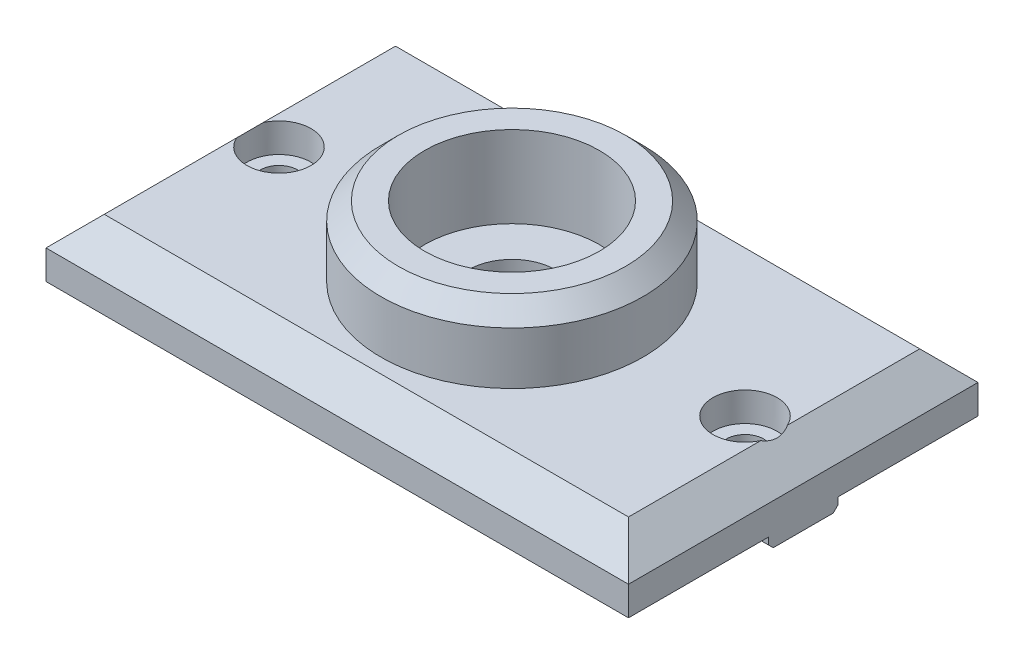
ISO-10303-21;
HEADER;
FILE_DESCRIPTION(('STEP AP214'),'2;1');
FILE_NAME('part.step','',(''),(''),'','','');
FILE_SCHEMA(('AUTOMOTIVE_DESIGN { 1 0 10303 214 1 1 1 1 }'));
ENDSEC;
DATA;
#1=APPLICATION_CONTEXT('core data for automotive mechanical design processes');
#2=APPLICATION_PROTOCOL_DEFINITION('international standard','automotive_design',2000,#1);
#3=PRODUCT_CONTEXT('',#1,'mechanical');
#4=PRODUCT('Part','Part','',(#3));
#5=PRODUCT_RELATED_PRODUCT_CATEGORY('part','',(#4));
#6=PRODUCT_DEFINITION_FORMATION('','',#4);
#7=PRODUCT_DEFINITION_CONTEXT('part definition',#1,'design');
#8=PRODUCT_DEFINITION('design','',#6,#7);
#9=PRODUCT_DEFINITION_SHAPE('','',#8);
#10=(LENGTH_UNIT() NAMED_UNIT(*) SI_UNIT(.MILLI.,.METRE.));
#11=(NAMED_UNIT(*) PLANE_ANGLE_UNIT() SI_UNIT($,.RADIAN.));
#12=(NAMED_UNIT(*) SI_UNIT($,.STERADIAN.) SOLID_ANGLE_UNIT());
#13=UNCERTAINTY_MEASURE_WITH_UNIT(LENGTH_MEASURE(1.E-05),#10,'distance_accuracy_value','');
#14=(GEOMETRIC_REPRESENTATION_CONTEXT(3) GLOBAL_UNCERTAINTY_ASSIGNED_CONTEXT((#13)) GLOBAL_UNIT_ASSIGNED_CONTEXT((#10,
#11,#12)) REPRESENTATION_CONTEXT('',''));
#15=CARTESIAN_POINT('',(0.,0.,0.));
#16=DIRECTION('',(0.,0.,1.));
#17=DIRECTION('',(1.,0.,0.));
#18=AXIS2_PLACEMENT_3D('',#15,#16,#17);
#19=CARTESIAN_POINT('',(50.,-1.99999999999999,-5.95));
#20=DIRECTION('',(0.,0.,-1.));
#21=DIRECTION('',(-1.,0.,0.));
#22=AXIS2_PLACEMENT_3D('',#19,#20,#21);
#23=PLANE('',#22);
#24=DIRECTION('',(0.,1.,0.));
#25=VECTOR('',#24,1.);
#26=CARTESIAN_POINT('',(50.,-1.99999999999999,-5.95));
#27=LINE('',#26,#25);
#28=CARTESIAN_POINT('',(50.,-1.2,-5.95));
#29=VERTEX_POINT('',#28);
#30=CARTESIAN_POINT('',(50.,0.,-5.95));
#31=VERTEX_POINT('',#30);
#32=EDGE_CURVE('E225',#29,#31,#27,.T.);
#33=ORIENTED_EDGE('',*,*,#32,.F.);
#34=DIRECTION('',(-1.,0.,0.));
#35=VECTOR('',#34,1.);
#36=CARTESIAN_POINT('',(4.56590626272594,-1.2,-5.95));
#37=LINE('',#36,#35);
#38=CARTESIAN_POINT('',(4.56590626272594,-1.2,-5.95));
#39=VERTEX_POINT('',#38);
#40=EDGE_CURVE('E11',#29,#39,#37,.T.);
#41=ORIENTED_EDGE('',*,*,#40,.T.);
#42=DIRECTION('',(0.,-1.,0.));
#43=VECTOR('',#42,1.);
#44=CARTESIAN_POINT('',(4.56590626272594,22.,-5.95));
#45=LINE('',#44,#43);
#46=CARTESIAN_POINT('',(4.56590626272594,0.,-5.95));
#47=VERTEX_POINT('',#46);
#48=EDGE_CURVE('E440',#39,#47,#45,.F.);
#49=ORIENTED_EDGE('',*,*,#48,.T.);
#50=DIRECTION('',(-1.,0.,0.));
#51=VECTOR('',#50,1.);
#52=CARTESIAN_POINT('',(50.,0.,-5.95));
#53=LINE('',#52,#51);
#54=EDGE_CURVE('E215',#31,#47,#53,.T.);
#55=ORIENTED_EDGE('',*,*,#54,.F.);
#56=EDGE_LOOP('',(#33,#41,#49,#55));
#57=FACE_BOUND('',#56,.T.);
#58=ADVANCED_FACE('F41',(#57),#23,.T.);
#59=DIRECTION('',(0.,-1.,0.));
#60=VECTOR('',#59,1.);
#61=CARTESIAN_POINT('',(-4.56590626272594,22.,-5.95));
#62=LINE('',#61,#60);
#63=CARTESIAN_POINT('',(-4.56590626272594,0.,-5.95));
#64=VERTEX_POINT('',#63);
#65=CARTESIAN_POINT('',(-4.56590626272594,-1.2,-5.95));
#66=VERTEX_POINT('',#65);
#67=EDGE_CURVE('E400',#64,#66,#62,.T.);
#68=ORIENTED_EDGE('',*,*,#67,.T.);
#69=DIRECTION('',(-1.,0.,0.));
#70=VECTOR('',#69,1.);
#71=CARTESIAN_POINT('',(-50.,-1.2,-5.95));
#72=LINE('',#71,#70);
#73=CARTESIAN_POINT('',(-50.,-1.2,-5.95));
#74=VERTEX_POINT('',#73);
#75=EDGE_CURVE('E51',#66,#74,#72,.T.);
#76=ORIENTED_EDGE('',*,*,#75,.T.);
#77=DIRECTION('',(0.,1.,0.));
#78=VECTOR('',#77,1.);
#79=CARTESIAN_POINT('',(-50.,-1.99999999999999,-5.95));
#80=LINE('',#79,#78);
#81=CARTESIAN_POINT('',(-50.,0.,-5.95));
#82=VERTEX_POINT('',#81);
#83=EDGE_CURVE('E234',#74,#82,#80,.T.);
#84=ORIENTED_EDGE('',*,*,#83,.T.);
#85=EDGE_CURVE('E221',#64,#82,#53,.T.);
#86=ORIENTED_EDGE('',*,*,#85,.F.);
#87=EDGE_LOOP('',(#68,#76,#84,#86));
#88=FACE_BOUND('',#87,.T.);
#89=ADVANCED_FACE('F397',(#88),#23,.T.);
#90=CARTESIAN_POINT('',(50.,-1.99999999999999,5.95));
#91=DIRECTION('',(0.,0.,1.));
#92=DIRECTION('',(1.,0.,0.));
#93=AXIS2_PLACEMENT_3D('',#90,#91,#92);
#94=PLANE('',#93);
#95=DIRECTION('',(0.,1.,0.));
#96=VECTOR('',#95,1.);
#97=CARTESIAN_POINT('',(-50.,-1.99999999999999,5.95));
#98=LINE('',#97,#96);
#99=CARTESIAN_POINT('',(-50.,-1.2,5.95));
#100=VERTEX_POINT('',#99);
#101=CARTESIAN_POINT('',(-50.,0.,5.95));
#102=VERTEX_POINT('',#101);
#103=EDGE_CURVE('E231',#100,#102,#98,.T.);
#104=ORIENTED_EDGE('',*,*,#103,.F.);
#105=DIRECTION('',(1.,0.,0.));
#106=VECTOR('',#105,1.);
#107=CARTESIAN_POINT('',(-4.56590626272594,-1.2,5.95));
#108=LINE('',#107,#106);
#109=CARTESIAN_POINT('',(-4.56590626272594,-1.2,5.95));
#110=VERTEX_POINT('',#109);
#111=EDGE_CURVE('E352',#100,#110,#108,.T.);
#112=ORIENTED_EDGE('',*,*,#111,.T.);
#113=DIRECTION('',(0.,-1.,0.));
#114=VECTOR('',#113,1.);
#115=CARTESIAN_POINT('',(-4.56590626272594,22.,5.95));
#116=LINE('',#115,#114);
#117=CARTESIAN_POINT('',(-4.56590626272594,0.,5.95));
#118=VERTEX_POINT('',#117);
#119=EDGE_CURVE('E209',#110,#118,#116,.F.);
#120=ORIENTED_EDGE('',*,*,#119,.T.);
#121=DIRECTION('',(1.,0.,0.));
#122=VECTOR('',#121,1.);
#123=CARTESIAN_POINT('',(50.,0.,5.95));
#124=LINE('',#123,#122);
#125=EDGE_CURVE('E207',#102,#118,#124,.T.);
#126=ORIENTED_EDGE('',*,*,#125,.F.);
#127=EDGE_LOOP('',(#104,#112,#120,#126));
#128=FACE_BOUND('',#127,.T.);
#129=ADVANCED_FACE('F490',(#128),#94,.T.);
#130=DIRECTION('',(0.,-1.,0.));
#131=VECTOR('',#130,1.);
#132=CARTESIAN_POINT('',(4.56590626272594,22.,5.95));
#133=LINE('',#132,#131);
#134=CARTESIAN_POINT('',(4.56590626272594,0.,5.95));
#135=VERTEX_POINT('',#134);
#136=CARTESIAN_POINT('',(4.56590626272594,-1.2,5.95));
#137=VERTEX_POINT('',#136);
#138=EDGE_CURVE('E182',#135,#137,#133,.T.);
#139=ORIENTED_EDGE('',*,*,#138,.T.);
#140=DIRECTION('',(1.,0.,0.));
#141=VECTOR('',#140,1.);
#142=CARTESIAN_POINT('',(50.,-1.2,5.95));
#143=LINE('',#142,#141);
#144=CARTESIAN_POINT('',(50.,-1.2,5.95));
#145=VERTEX_POINT('',#144);
#146=EDGE_CURVE('E379',#137,#145,#143,.T.);
#147=ORIENTED_EDGE('',*,*,#146,.T.);
#148=DIRECTION('',(0.,1.,0.));
#149=VECTOR('',#148,1.);
#150=CARTESIAN_POINT('',(50.,-1.99999999999999,5.95));
#151=LINE('',#150,#149);
#152=CARTESIAN_POINT('',(50.,0.,5.95));
#153=VERTEX_POINT('',#152);
#154=EDGE_CURVE('E213',#145,#153,#151,.T.);
#155=ORIENTED_EDGE('',*,*,#154,.T.);
#156=EDGE_CURVE('E203',#135,#153,#124,.T.);
#157=ORIENTED_EDGE('',*,*,#156,.F.);
#158=EDGE_LOOP('',(#139,#147,#155,#157));
#159=FACE_BOUND('',#158,.T.);
#160=ADVANCED_FACE('F211',(#159),#94,.T.);
#161=CARTESIAN_POINT('',(0.,-1.99999999999999,0.));
#162=DIRECTION('',(0.,1.,0.));
#163=DIRECTION('',(0.,0.,1.));
#164=AXIS2_PLACEMENT_3D('',#161,#162,#163);
#165=PLANE('',#164);
#166=CARTESIAN_POINT('',(0.,-1.99999999999999,0.));
#167=DIRECTION('',(0.,1.,0.));
#168=DIRECTION('',(0.,0.,1.));
#169=AXIS2_PLACEMENT_3D('',#166,#167,#168);
#170=CIRCLE('',#169,7.5);
#171=CARTESIAN_POINT('',(-5.45229309556997,-1.99999999999999,5.15000000000001));
#172=VERTEX_POINT('',#171);
#173=CARTESIAN_POINT('',(-5.45229309556997,-1.99999999999999,-5.15000000000001));
#174=VERTEX_POINT('',#173);
#175=EDGE_CURVE('E278',#172,#174,#170,.F.);
#176=ORIENTED_EDGE('',*,*,#175,.F.);
#177=DIRECTION('',(-1.,0.,0.));
#178=VECTOR('',#177,1.);
#179=CARTESIAN_POINT('',(-50.,-1.99999999999999,5.15000000000001));
#180=LINE('',#179,#178);
#181=CARTESIAN_POINT('',(-50.,-1.99999999999999,5.15000000000001));
#182=VERTEX_POINT('',#181);
#183=EDGE_CURVE('E370',#172,#182,#180,.T.);
#184=ORIENTED_EDGE('',*,*,#183,.T.);
#185=DIRECTION('',(0.,0.,1.));
#186=VECTOR('',#185,1.);
#187=CARTESIAN_POINT('',(-50.,-1.99999999999999,-5.95));
#188=LINE('',#187,#186);
#189=CARTESIAN_POINT('',(-50.,-1.99999999999999,-5.15));
#190=VERTEX_POINT('',#189);
#191=EDGE_CURVE('E219',#190,#182,#188,.T.);
#192=ORIENTED_EDGE('',*,*,#191,.F.);
#193=DIRECTION('',(1.,0.,0.));
#194=VECTOR('',#193,1.);
#195=CARTESIAN_POINT('',(-4.56590626272594,-1.99999999999999,-5.15000000000001));
#196=LINE('',#195,#194);
#197=EDGE_CURVE('E367',#190,#174,#196,.T.);
#198=ORIENTED_EDGE('',*,*,#197,.T.);
#199=EDGE_LOOP('',(#176,#184,#192,#198));
#200=FACE_BOUND('',#199,.T.);
#201=CARTESIAN_POINT('',(-40.,-1.99999999999999,0.));
#202=DIRECTION('',(0.,1.,0.));
#203=DIRECTION('',(0.,0.,1.));
#204=AXIS2_PLACEMENT_3D('',#201,#202,#203);
#205=CIRCLE('',#204,3.2);
#206=CARTESIAN_POINT('',(-40.,-1.99999999999999,3.2));
#207=VERTEX_POINT('',#206);
#208=EDGE_CURVE('E417',#207,#207,#205,.T.);
#209=ORIENTED_EDGE('',*,*,#208,.T.);
#210=EDGE_LOOP('',(#209));
#211=FACE_BOUND('',#210,.T.);
#212=ADVANCED_FACE('F518',(#200,#211),#165,.F.);
#213=CARTESIAN_POINT('',(0.,0.,0.));
#214=DIRECTION('',(0.,-1.,0.));
#215=DIRECTION('',(0.,0.,-1.));
#216=AXIS2_PLACEMENT_3D('',#213,#214,#215);
#217=PLANE('',#216);
#218=ORIENTED_EDGE('',*,*,#54,.T.);
#219=CARTESIAN_POINT('',(0.,0.,0.));
#220=DIRECTION('',(0.,-1.,0.));
#221=DIRECTION('',(0.,0.,-1.));
#222=AXIS2_PLACEMENT_3D('',#219,#220,#221);
#223=CIRCLE('',#222,7.5);
#224=EDGE_CURVE('E415',#47,#64,#223,.F.);
#225=ORIENTED_EDGE('',*,*,#224,.T.);
#226=ORIENTED_EDGE('',*,*,#85,.T.);
#227=DIRECTION('',(0.,0.,1.));
#228=VECTOR('',#227,1.);
#229=CARTESIAN_POINT('',(-50.,0.,30.));
#230=LINE('',#229,#228);
#231=CARTESIAN_POINT('',(-50.,0.,-30.));
#232=VERTEX_POINT('',#231);
#233=EDGE_CURVE('E258',#232,#82,#230,.T.);
#234=ORIENTED_EDGE('',*,*,#233,.F.);
#235=DIRECTION('',(-1.,0.,0.));
#236=VECTOR('',#235,1.);
#237=CARTESIAN_POINT('',(-50.,0.,-30.));
#238=LINE('',#237,#236);
#239=CARTESIAN_POINT('',(50.,0.,-30.));
#240=VERTEX_POINT('',#239);
#241=EDGE_CURVE('E253',#240,#232,#238,.T.);
#242=ORIENTED_EDGE('',*,*,#241,.F.);
#243=DIRECTION('',(0.,0.,-1.));
#244=VECTOR('',#243,1.);
#245=CARTESIAN_POINT('',(50.,0.,30.));
#246=LINE('',#245,#244);
#247=EDGE_CURVE('E249',#31,#240,#246,.T.);
#248=ORIENTED_EDGE('',*,*,#247,.F.);
#249=EDGE_LOOP('',(#218,#225,#226,#234,#242,#248));
#250=FACE_BOUND('',#249,.T.);
#251=ADVANCED_FACE('F411',(#250),#217,.T.);
#252=ORIENTED_EDGE('',*,*,#125,.T.);
#253=CARTESIAN_POINT('',(0.,0.,0.));
#254=DIRECTION('',(0.,-1.,0.));
#255=DIRECTION('',(0.,0.,-1.));
#256=AXIS2_PLACEMENT_3D('',#253,#254,#255);
#257=CIRCLE('',#256,7.5);
#258=EDGE_CURVE('E187',#118,#135,#257,.F.);
#259=ORIENTED_EDGE('',*,*,#258,.T.);
#260=ORIENTED_EDGE('',*,*,#156,.T.);
#261=CARTESIAN_POINT('',(50.,0.,30.));
#262=VERTEX_POINT('',#261);
#263=EDGE_CURVE('E250',#262,#153,#246,.T.);
#264=ORIENTED_EDGE('',*,*,#263,.F.);
#265=DIRECTION('',(1.,0.,0.));
#266=VECTOR('',#265,1.);
#267=CARTESIAN_POINT('',(-50.,0.,30.));
#268=LINE('',#267,#266);
#269=CARTESIAN_POINT('',(-50.,0.,30.));
#270=VERTEX_POINT('',#269);
#271=EDGE_CURVE('E262',#270,#262,#268,.T.);
#272=ORIENTED_EDGE('',*,*,#271,.F.);
#273=EDGE_CURVE('E257',#102,#270,#230,.T.);
#274=ORIENTED_EDGE('',*,*,#273,.F.);
#275=EDGE_LOOP('',(#252,#259,#260,#264,#272,#274));
#276=FACE_BOUND('',#275,.T.);
#277=ADVANCED_FACE('F201',(#276),#217,.T.);
#278=CARTESIAN_POINT('',(50.,10.,30.));
#279=DIRECTION('',(-1.,0.,0.));
#280=DIRECTION('',(0.,0.,1.));
#281=AXIS2_PLACEMENT_3D('',#278,#279,#280);
#282=PLANE('',#281);
#283=ORIENTED_EDGE('',*,*,#154,.F.);
#284=DIRECTION('',(0.,-0.707106781186548,-0.707106781186547));
#285=VECTOR('',#284,1.);
#286=CARTESIAN_POINT('',(50.,-1.2,5.95));
#287=LINE('',#286,#285);
#288=CARTESIAN_POINT('',(50.,-1.99999999999999,5.15));
#289=VERTEX_POINT('',#288);
#290=EDGE_CURVE('E384',#145,#289,#287,.T.);
#291=ORIENTED_EDGE('',*,*,#290,.T.);
#292=DIRECTION('',(0.,0.,-1.));
#293=VECTOR('',#292,1.);
#294=CARTESIAN_POINT('',(50.,-1.99999999999999,-5.95));
#295=LINE('',#294,#293);
#296=CARTESIAN_POINT('',(50.,-1.99999999999999,-5.15000000000001));
#297=VERTEX_POINT('',#296);
#298=EDGE_CURVE('E237',#289,#297,#295,.T.);
#299=ORIENTED_EDGE('',*,*,#298,.T.);
#300=DIRECTION('',(0.,0.707106781186547,-0.707106781186548));
#301=VECTOR('',#300,1.);
#302=CARTESIAN_POINT('',(50.,-1.2,-5.95));
#303=LINE('',#302,#301);
#304=EDGE_CURVE('E58',#297,#29,#303,.T.);
#305=ORIENTED_EDGE('',*,*,#304,.T.);
#306=ORIENTED_EDGE('',*,*,#32,.T.);
#307=ORIENTED_EDGE('',*,*,#247,.T.);
#308=DIRECTION('',(0.,-1.,0.));
#309=VECTOR('',#308,1.);
#310=CARTESIAN_POINT('',(50.,10.,-30.));
#311=LINE('',#310,#309);
#312=CARTESIAN_POINT('',(50.,4.99999999999996,-30.));
#313=VERTEX_POINT('',#312);
#314=EDGE_CURVE('E275',#313,#240,#311,.T.);
#315=ORIENTED_EDGE('',*,*,#314,.F.);
#316=DIRECTION('',(0.,0.,1.));
#317=VECTOR('',#316,1.);
#318=CARTESIAN_POINT('',(50.,4.99999999999996,30.));
#319=LINE('',#318,#317);
#320=CARTESIAN_POINT('',(50.,4.99999999999996,30.));
#321=VERTEX_POINT('',#320);
#322=EDGE_CURVE('E326',#313,#321,#319,.T.);
#323=ORIENTED_EDGE('',*,*,#322,.T.);
#324=DIRECTION('',(0.,-1.,0.));
#325=VECTOR('',#324,1.);
#326=CARTESIAN_POINT('',(50.,10.,30.));
#327=LINE('',#326,#325);
#328=EDGE_CURVE('E266',#321,#262,#327,.T.);
#329=ORIENTED_EDGE('',*,*,#328,.T.);
#330=ORIENTED_EDGE('',*,*,#263,.T.);
#331=EDGE_LOOP('',(#283,#291,#299,#305,#306,#307,#315,#323,#329,#330));
#332=FACE_BOUND('',#331,.T.);
#333=ADVANCED_FACE('F433',(#332),#282,.F.);
#334=CARTESIAN_POINT('',(-50.,10.,-30.));
#335=DIRECTION('',(0.,0.,1.));
#336=DIRECTION('',(1.,0.,0.));
#337=AXIS2_PLACEMENT_3D('',#334,#335,#336);
#338=PLANE('',#337);
#339=DIRECTION('',(0.,-1.,0.));
#340=VECTOR('',#339,1.);
#341=CARTESIAN_POINT('',(-50.,10.,-30.));
#342=LINE('',#341,#340);
#343=CARTESIAN_POINT('',(-50.,4.99999999999996,-30.));
#344=VERTEX_POINT('',#343);
#345=EDGE_CURVE('E272',#344,#232,#342,.T.);
#346=ORIENTED_EDGE('',*,*,#345,.F.);
#347=DIRECTION('',(1.,0.,0.));
#348=VECTOR('',#347,1.);
#349=CARTESIAN_POINT('',(-50.,4.99999999999996,-30.));
#350=LINE('',#349,#348);
#351=EDGE_CURVE('E320',#344,#313,#350,.T.);
#352=ORIENTED_EDGE('',*,*,#351,.T.);
#353=ORIENTED_EDGE('',*,*,#314,.T.);
#354=ORIENTED_EDGE('',*,*,#241,.T.);
#355=EDGE_LOOP('',(#346,#352,#353,#354));
#356=FACE_BOUND('',#355,.T.);
#357=ADVANCED_FACE('F524',(#356),#338,.F.);
#358=CARTESIAN_POINT('',(-50.,10.,30.));
#359=DIRECTION('',(1.,0.,0.));
#360=DIRECTION('',(0.,0.,-1.));
#361=AXIS2_PLACEMENT_3D('',#358,#359,#360);
#362=PLANE('',#361);
#363=ORIENTED_EDGE('',*,*,#191,.T.);
#364=DIRECTION('',(0.,0.707106781186548,0.707106781186547));
#365=VECTOR('',#364,1.);
#366=CARTESIAN_POINT('',(-50.,-1.2,5.95));
#367=LINE('',#366,#365);
#368=EDGE_CURVE('E376',#182,#100,#367,.T.);
#369=ORIENTED_EDGE('',*,*,#368,.T.);
#370=ORIENTED_EDGE('',*,*,#103,.T.);
#371=ORIENTED_EDGE('',*,*,#273,.T.);
#372=DIRECTION('',(0.,-1.,0.));
#373=VECTOR('',#372,1.);
#374=CARTESIAN_POINT('',(-50.,10.,30.));
#375=LINE('',#374,#373);
#376=CARTESIAN_POINT('',(-50.,4.99999999999996,30.));
#377=VERTEX_POINT('',#376);
#378=EDGE_CURVE('E269',#377,#270,#375,.T.);
#379=ORIENTED_EDGE('',*,*,#378,.F.);
#380=DIRECTION('',(0.,0.,-1.));
#381=VECTOR('',#380,1.);
#382=CARTESIAN_POINT('',(-50.,4.99999999999996,30.));
#383=LINE('',#382,#381);
#384=EDGE_CURVE('E317',#377,#344,#383,.T.);
#385=ORIENTED_EDGE('',*,*,#384,.T.);
#386=ORIENTED_EDGE('',*,*,#345,.T.);
#387=ORIENTED_EDGE('',*,*,#233,.T.);
#388=ORIENTED_EDGE('',*,*,#83,.F.);
#389=DIRECTION('',(0.,-0.707106781186547,0.707106781186548));
#390=VECTOR('',#389,1.);
#391=CARTESIAN_POINT('',(-50.,-1.19999999999999,-5.95));
#392=LINE('',#391,#390);
#393=EDGE_CURVE('E373',#74,#190,#392,.T.);
#394=ORIENTED_EDGE('',*,*,#393,.T.);
#395=EDGE_LOOP('',(#363,#369,#370,#371,#379,#385,#386,#387,#388,#394));
#396=FACE_BOUND('',#395,.T.);
#397=ADVANCED_FACE('F405',(#396),#362,.F.);
#398=CARTESIAN_POINT('',(-50.,10.,30.));
#399=DIRECTION('',(0.,0.,-1.));
#400=DIRECTION('',(-1.,0.,0.));
#401=AXIS2_PLACEMENT_3D('',#398,#399,#400);
#402=PLANE('',#401);
#403=ORIENTED_EDGE('',*,*,#328,.F.);
#404=DIRECTION('',(-1.,0.,0.));
#405=VECTOR('',#404,1.);
#406=CARTESIAN_POINT('',(-50.,4.99999999999996,30.));
#407=LINE('',#406,#405);
#408=EDGE_CURVE('E310',#321,#377,#407,.T.);
#409=ORIENTED_EDGE('',*,*,#408,.T.);
#410=ORIENTED_EDGE('',*,*,#378,.T.);
#411=ORIENTED_EDGE('',*,*,#271,.T.);
#412=EDGE_LOOP('',(#403,#409,#410,#411));
#413=FACE_BOUND('',#412,.T.);
#414=ADVANCED_FACE('F514',(#413),#402,.F.);
#415=CARTESIAN_POINT('',(0.,10.,0.));
#416=DIRECTION('',(0.,-1.,0.));
#417=DIRECTION('',(0.,0.,-1.));
#418=AXIS2_PLACEMENT_3D('',#415,#416,#417);
#419=PLANE('',#418);
#420=CARTESIAN_POINT('',(-40.,10.,0.));
#421=DIRECTION('',(0.,-1.,0.));
#422=DIRECTION('',(0.,0.,-1.));
#423=AXIS2_PLACEMENT_3D('',#420,#421,#422);
#424=CIRCLE('',#423,5.5);
#425=CARTESIAN_POINT('',(-44.9999999999999,10.,-2.29128784747814));
#426=VERTEX_POINT('',#425);
#427=CARTESIAN_POINT('',(-44.9999999999999,10.,2.29128784747814));
#428=VERTEX_POINT('',#427);
#429=EDGE_CURVE('E344',#426,#428,#424,.T.);
#430=ORIENTED_EDGE('',*,*,#429,.T.);
#431=DIRECTION('',(0.,0.,1.));
#432=VECTOR('',#431,1.);
#433=CARTESIAN_POINT('',(-44.9999999999999,10.,0.));
#434=LINE('',#433,#432);
#435=CARTESIAN_POINT('',(-44.9999999999999,10.,24.9999999999999));
#436=VERTEX_POINT('',#435);
#437=EDGE_CURVE('E307',#428,#436,#434,.T.);
#438=ORIENTED_EDGE('',*,*,#437,.T.);
#439=DIRECTION('',(1.,0.,0.));
#440=VECTOR('',#439,1.);
#441=CARTESIAN_POINT('',(0.,10.,24.9999999999999));
#442=LINE('',#441,#440);
#443=CARTESIAN_POINT('',(44.9999999999999,10.,24.9999999999999));
#444=VERTEX_POINT('',#443);
#445=EDGE_CURVE('E303',#436,#444,#442,.T.);
#446=ORIENTED_EDGE('',*,*,#445,.T.);
#447=DIRECTION('',(0.,0.,-1.));
#448=VECTOR('',#447,1.);
#449=CARTESIAN_POINT('',(44.9999999999999,10.,0.));
#450=LINE('',#449,#448);
#451=CARTESIAN_POINT('',(44.9999999999999,10.,2.29128784747805));
#452=VERTEX_POINT('',#451);
#453=EDGE_CURVE('E300',#444,#452,#450,.T.);
#454=ORIENTED_EDGE('',*,*,#453,.T.);
#455=CARTESIAN_POINT('',(40.,10.,0.));
#456=DIRECTION('',(0.,-1.,0.));
#457=DIRECTION('',(0.,0.,-1.));
#458=AXIS2_PLACEMENT_3D('',#455,#456,#457);
#459=CIRCLE('',#458,5.5);
#460=CARTESIAN_POINT('',(44.9999999999999,10.,-2.29128784747805));
#461=VERTEX_POINT('',#460);
#462=EDGE_CURVE('E460',#452,#461,#459,.T.);
#463=ORIENTED_EDGE('',*,*,#462,.T.);
#464=DIRECTION('',(0.,0.,-1.));
#465=VECTOR('',#464,1.);
#466=CARTESIAN_POINT('',(44.9999999999999,10.,0.));
#467=LINE('',#466,#465);
#468=CARTESIAN_POINT('',(44.9999999999999,10.,-24.9999999999999));
#469=VERTEX_POINT('',#468);
#470=EDGE_CURVE('E282',#461,#469,#467,.T.);
#471=ORIENTED_EDGE('',*,*,#470,.T.);
#472=DIRECTION('',(-1.,0.,0.));
#473=VECTOR('',#472,1.);
#474=CARTESIAN_POINT('',(0.,10.,-24.9999999999999));
#475=LINE('',#474,#473);
#476=CARTESIAN_POINT('',(-44.9999999999999,10.,-24.9999999999999));
#477=VERTEX_POINT('',#476);
#478=EDGE_CURVE('E294',#469,#477,#475,.T.);
#479=ORIENTED_EDGE('',*,*,#478,.T.);
#480=DIRECTION('',(0.,0.,1.));
#481=VECTOR('',#480,1.);
#482=CARTESIAN_POINT('',(-44.9999999999999,10.,0.));
#483=LINE('',#482,#481);
#484=EDGE_CURVE('E297',#477,#426,#483,.T.);
#485=ORIENTED_EDGE('',*,*,#484,.T.);
#486=EDGE_LOOP('',(#430,#438,#446,#454,#463,#471,#479,#485));
#487=FACE_BOUND('',#486,.T.);
#488=CARTESIAN_POINT('',(0.,10.,0.));
#489=DIRECTION('',(0.,-1.,0.));
#490=DIRECTION('',(0.,0.,-1.));
#491=AXIS2_PLACEMENT_3D('',#488,#489,#490);
#492=CIRCLE('',#491,22.5);
#493=CARTESIAN_POINT('',(0.,10.,-22.5));
#494=VERTEX_POINT('',#493);
#495=EDGE_CURVE('E242',#494,#494,#492,.T.);
#496=ORIENTED_EDGE('',*,*,#495,.T.);
#497=EDGE_LOOP('',(#496));
#498=FACE_BOUND('',#497,.T.);
#499=ADVANCED_FACE('F510',(#487,#498),#419,.F.);
#500=CARTESIAN_POINT('',(0.,22.,0.));
#501=DIRECTION('',(0.,-1.,0.));
#502=DIRECTION('',(0.,0.,-1.));
#503=AXIS2_PLACEMENT_3D('',#500,#501,#502);
#504=CYLINDRICAL_SURFACE('',#503,22.5);
#505=CARTESIAN_POINT('',(0.,19.,0.));
#506=DIRECTION('',(0.,-1.,0.));
#507=DIRECTION('',(0.,0.,-1.));
#508=AXIS2_PLACEMENT_3D('',#505,#506,#507);
#509=CIRCLE('',#508,22.5);
#510=CARTESIAN_POINT('',(0.,19.,-22.5));
#511=VERTEX_POINT('',#510);
#512=EDGE_CURVE('E329',#511,#511,#509,.T.);
#513=ORIENTED_EDGE('',*,*,#512,.T.);
#514=EDGE_LOOP('',(#513));
#515=FACE_BOUND('',#514,.T.);
#516=ORIENTED_EDGE('',*,*,#495,.F.);
#517=EDGE_LOOP('',(#516));
#518=FACE_BOUND('',#517,.T.);
#519=ADVANCED_FACE('F506',(#515,#518),#504,.T.);
#520=CARTESIAN_POINT('',(0.,22.,0.));
#521=DIRECTION('',(0.,-1.,0.));
#522=DIRECTION('',(0.,0.,-1.));
#523=AXIS2_PLACEMENT_3D('',#520,#521,#522);
#524=PLANE('',#523);
#525=CARTESIAN_POINT('',(0.,22.,0.));
#526=DIRECTION('',(0.,-1.,0.));
#527=DIRECTION('',(0.,0.,-1.));
#528=AXIS2_PLACEMENT_3D('',#525,#526,#527);
#529=CIRCLE('',#528,19.5);
#530=CARTESIAN_POINT('',(0.,22.,-19.5));
#531=VERTEX_POINT('',#530);
#532=EDGE_CURVE('E348',#531,#531,#529,.F.);
#533=ORIENTED_EDGE('',*,*,#532,.T.);
#534=EDGE_LOOP('',(#533));
#535=FACE_BOUND('',#534,.T.);
#536=CARTESIAN_POINT('',(0.,22.,0.));
#537=DIRECTION('',(0.,-1.,0.));
#538=DIRECTION('',(0.,0.,-1.));
#539=AXIS2_PLACEMENT_3D('',#536,#537,#538);
#540=CIRCLE('',#539,15.);
#541=CARTESIAN_POINT('',(0.,22.,-15.));
#542=VERTEX_POINT('',#541);
#543=EDGE_CURVE('E228',#542,#542,#540,.T.);
#544=ORIENTED_EDGE('',*,*,#543,.T.);
#545=EDGE_LOOP('',(#544));
#546=FACE_BOUND('',#545,.T.);
#547=ADVANCED_FACE('F502',(#535,#546),#524,.F.);
#548=CARTESIAN_POINT('',(0.,8.,0.));
#549=DIRECTION('',(0.,1.,0.));
#550=DIRECTION('',(0.,0.,1.));
#551=AXIS2_PLACEMENT_3D('',#548,#549,#550);
#552=CYLINDRICAL_SURFACE('',#551,15.);
#553=CARTESIAN_POINT('',(0.,8.,0.));
#554=DIRECTION('',(0.,-1.,0.));
#555=DIRECTION('',(0.,0.,-1.));
#556=AXIS2_PLACEMENT_3D('',#553,#554,#555);
#557=CIRCLE('',#556,15.);
#558=CARTESIAN_POINT('',(0.,8.,-15.));
#559=VERTEX_POINT('',#558);
#560=EDGE_CURVE('E238',#559,#559,#557,.T.);
#561=ORIENTED_EDGE('',*,*,#560,.T.);
#562=EDGE_LOOP('',(#561));
#563=FACE_BOUND('',#562,.T.);
#564=ORIENTED_EDGE('',*,*,#543,.F.);
#565=EDGE_LOOP('',(#564));
#566=FACE_BOUND('',#565,.T.);
#567=ADVANCED_FACE('F498',(#563,#566),#552,.F.);
#568=CARTESIAN_POINT('',(0.,8.,0.));
#569=DIRECTION('',(0.,-1.,0.));
#570=DIRECTION('',(0.,0.,-1.));
#571=AXIS2_PLACEMENT_3D('',#568,#569,#570);
#572=PLANE('',#571);
#573=CARTESIAN_POINT('',(0.,8.,0.));
#574=DIRECTION('',(0.,-1.,0.));
#575=DIRECTION('',(0.,0.,-1.));
#576=AXIS2_PLACEMENT_3D('',#573,#574,#575);
#577=CIRCLE('',#576,7.5);
#578=CARTESIAN_POINT('',(0.,8.,-7.5));
#579=VERTEX_POINT('',#578);
#580=EDGE_CURVE('E426',#579,#579,#577,.F.);
#581=ORIENTED_EDGE('',*,*,#580,.F.);
#582=EDGE_LOOP('',(#581));
#583=FACE_BOUND('',#582,.T.);
#584=ORIENTED_EDGE('',*,*,#560,.F.);
#585=EDGE_LOOP('',(#584));
#586=FACE_BOUND('',#585,.T.);
#587=ADVANCED_FACE('F494',(#583,#586),#572,.F.);
#588=ORIENTED_EDGE('',*,*,#298,.F.);
#589=DIRECTION('',(-1.,0.,0.));
#590=VECTOR('',#589,1.);
#591=CARTESIAN_POINT('',(4.56590626272594,-1.99999999999999,5.15000000000001));
#592=LINE('',#591,#590);
#593=CARTESIAN_POINT('',(5.45229309556997,-1.99999999999999,5.15000000000001));
#594=VERTEX_POINT('',#593);
#595=EDGE_CURVE('E389',#289,#594,#592,.T.);
#596=ORIENTED_EDGE('',*,*,#595,.T.);
#597=CARTESIAN_POINT('',(0.,-1.99999999999999,0.));
#598=DIRECTION('',(0.,1.,0.));
#599=DIRECTION('',(0.,0.,1.));
#600=AXIS2_PLACEMENT_3D('',#597,#598,#599);
#601=CIRCLE('',#600,7.5);
#602=CARTESIAN_POINT('',(5.45229309556997,-1.99999999999999,-5.15000000000001));
#603=VERTEX_POINT('',#602);
#604=EDGE_CURVE('E197',#594,#603,#601,.T.);
#605=ORIENTED_EDGE('',*,*,#604,.T.);
#606=DIRECTION('',(1.,0.,0.));
#607=VECTOR('',#606,1.);
#608=CARTESIAN_POINT('',(50.,-1.99999999999999,-5.15000000000001));
#609=LINE('',#608,#607);
#610=EDGE_CURVE('E66',#603,#297,#609,.T.);
#611=ORIENTED_EDGE('',*,*,#610,.T.);
#612=EDGE_LOOP('',(#588,#596,#605,#611));
#613=FACE_BOUND('',#612,.T.);
#614=CARTESIAN_POINT('',(40.,-1.99999999999999,0.));
#615=DIRECTION('',(0.,1.,0.));
#616=DIRECTION('',(0.,0.,1.));
#617=AXIS2_PLACEMENT_3D('',#614,#615,#616);
#618=CIRCLE('',#617,3.2);
#619=CARTESIAN_POINT('',(40.,-1.99999999999999,3.2));
#620=VERTEX_POINT('',#619);
#621=EDGE_CURVE('E420',#620,#620,#618,.T.);
#622=ORIENTED_EDGE('',*,*,#621,.T.);
#623=EDGE_LOOP('',(#622));
#624=FACE_BOUND('',#623,.T.);
#625=ADVANCED_FACE('F497',(#613,#624),#165,.F.);
#626=CARTESIAN_POINT('',(40.,22.,0.));
#627=DIRECTION('',(0.,-1.,0.));
#628=DIRECTION('',(0.,0.,-1.));
#629=AXIS2_PLACEMENT_3D('',#626,#627,#628);
#630=CYLINDRICAL_SURFACE('',#629,3.2);
#631=CARTESIAN_POINT('',(40.,5.,0.));
#632=DIRECTION('',(0.,-1.,0.));
#633=DIRECTION('',(0.,0.,-1.));
#634=AXIS2_PLACEMENT_3D('',#631,#632,#633);
#635=CIRCLE('',#634,3.2);
#636=CARTESIAN_POINT('',(40.,5.,-3.2));
#637=VERTEX_POINT('',#636);
#638=EDGE_CURVE('E287',#637,#637,#635,.T.);
#639=ORIENTED_EDGE('',*,*,#638,.F.);
#640=EDGE_LOOP('',(#639));
#641=FACE_BOUND('',#640,.T.);
#642=ORIENTED_EDGE('',*,*,#621,.F.);
#643=EDGE_LOOP('',(#642));
#644=FACE_BOUND('',#643,.T.);
#645=ADVANCED_FACE('F631',(#641,#644),#630,.F.);
#646=CARTESIAN_POINT('',(-40.,22.,0.));
#647=DIRECTION('',(0.,-1.,0.));
#648=DIRECTION('',(0.,0.,-1.));
#649=AXIS2_PLACEMENT_3D('',#646,#647,#648);
#650=CYLINDRICAL_SURFACE('',#649,3.2);
#651=CARTESIAN_POINT('',(-40.,5.,0.));
#652=DIRECTION('',(0.,-1.,0.));
#653=DIRECTION('',(0.,0.,-1.));
#654=AXIS2_PLACEMENT_3D('',#651,#652,#653);
#655=CIRCLE('',#654,3.2);
#656=CARTESIAN_POINT('',(-40.,5.,-3.2));
#657=VERTEX_POINT('',#656);
#658=EDGE_CURVE('E283',#657,#657,#655,.T.);
#659=ORIENTED_EDGE('',*,*,#658,.F.);
#660=EDGE_LOOP('',(#659));
#661=FACE_BOUND('',#660,.T.);
#662=ORIENTED_EDGE('',*,*,#208,.F.);
#663=EDGE_LOOP('',(#662));
#664=FACE_BOUND('',#663,.T.);
#665=ADVANCED_FACE('F626',(#661,#664),#650,.F.);
#666=CARTESIAN_POINT('',(0.,22.,0.));
#667=DIRECTION('',(0.,-1.,0.));
#668=DIRECTION('',(0.,0.,-1.));
#669=AXIS2_PLACEMENT_3D('',#666,#667,#668);
#670=CYLINDRICAL_SURFACE('',#669,7.5);
#671=ORIENTED_EDGE('',*,*,#119,.F.);
#672=CARTESIAN_POINT('',(0.,-7.15,0.));
#673=DIRECTION('',(0.,-0.707106781186547,0.707106781186548));
#674=DIRECTION('',(0.,-0.707106781186548,-0.707106781186547));
#675=AXIS2_PLACEMENT_3D('',#672,#673,#674);
#676=ELLIPSE('',#675,10.6066017177982,7.5);
#677=EDGE_CURVE('E364',#110,#172,#676,.T.);
#678=ORIENTED_EDGE('',*,*,#677,.T.);
#679=ORIENTED_EDGE('',*,*,#175,.T.);
#680=CARTESIAN_POINT('',(0.,-7.14999999999999,0.));
#681=DIRECTION('',(0.,-0.707106781186548,-0.707106781186547));
#682=DIRECTION('',(0.,-0.707106781186547,0.707106781186548));
#683=AXIS2_PLACEMENT_3D('',#680,#681,#682);
#684=ELLIPSE('',#683,10.6066017177982,7.5);
#685=EDGE_CURVE('E359',#174,#66,#684,.T.);
#686=ORIENTED_EDGE('',*,*,#685,.T.);
#687=ORIENTED_EDGE('',*,*,#67,.F.);
#688=ORIENTED_EDGE('',*,*,#224,.F.);
#689=ORIENTED_EDGE('',*,*,#48,.F.);
#690=CARTESIAN_POINT('',(0.,-7.14999999999999,0.));
#691=DIRECTION('',(0.,-0.707106781186548,-0.707106781186547));
#692=DIRECTION('',(0.,-0.707106781186547,0.707106781186548));
#693=AXIS2_PLACEMENT_3D('',#690,#691,#692);
#694=ELLIPSE('',#693,10.6066017177982,7.5);
#695=EDGE_CURVE('E356',#39,#603,#694,.T.);
#696=ORIENTED_EDGE('',*,*,#695,.T.);
#697=ORIENTED_EDGE('',*,*,#604,.F.);
#698=CARTESIAN_POINT('',(0.,-7.15,0.));
#699=DIRECTION('',(0.,-0.707106781186547,0.707106781186548));
#700=DIRECTION('',(0.,-0.707106781186548,-0.707106781186547));
#701=AXIS2_PLACEMENT_3D('',#698,#699,#700);
#702=ELLIPSE('',#701,10.6066017177982,7.5);
#703=EDGE_CURVE('E191',#594,#137,#702,.T.);
#704=ORIENTED_EDGE('',*,*,#703,.T.);
#705=ORIENTED_EDGE('',*,*,#138,.F.);
#706=ORIENTED_EDGE('',*,*,#258,.F.);
#707=EDGE_LOOP('',(#671,#678,#679,#686,#687,#688,#689,#696,#697,#704,#705,#706));
#708=FACE_BOUND('',#707,.T.);
#709=ORIENTED_EDGE('',*,*,#580,.T.);
#710=EDGE_LOOP('',(#709));
#711=FACE_BOUND('',#710,.T.);
#712=ADVANCED_FACE('F185',(#708,#711),#670,.F.);
#713=CARTESIAN_POINT('',(-40.,5.,0.));
#714=DIRECTION('',(0.,1.,0.));
#715=DIRECTION('',(0.,0.,1.));
#716=AXIS2_PLACEMENT_3D('',#713,#714,#715);
#717=CYLINDRICAL_SURFACE('',#716,5.5);
#718=CARTESIAN_POINT('',(-40.,5.,0.));
#719=DIRECTION('',(0.,-1.,0.));
#720=DIRECTION('',(0.,0.,-1.));
#721=AXIS2_PLACEMENT_3D('',#718,#719,#720);
#722=CIRCLE('',#721,5.5);
#723=CARTESIAN_POINT('',(-40.,5.,-5.5));
#724=VERTEX_POINT('',#723);
#725=EDGE_CURVE('E456',#724,#724,#722,.T.);
#726=ORIENTED_EDGE('',*,*,#725,.T.);
#727=EDGE_LOOP('',(#726));
#728=FACE_BOUND('',#727,.T.);
#729=ORIENTED_EDGE('',*,*,#429,.F.);
#730=CARTESIAN_POINT('',(-40.,14.9999999999998,0.));
#731=DIRECTION('',(0.707106781186544,-0.707106781186551,0.));
#732=DIRECTION('',(0.707106781186551,0.707106781186544,0.));
#733=AXIS2_PLACEMENT_3D('',#730,#731,#732);
#734=ELLIPSE('',#733,7.77817459305198,5.5);
#735=EDGE_CURVE('E314',#426,#428,#734,.F.);
#736=ORIENTED_EDGE('',*,*,#735,.T.);
#737=EDGE_LOOP('',(#729,#736));
#738=FACE_BOUND('',#737,.T.);
#739=ADVANCED_FACE('F616',(#728,#738),#717,.F.);
#740=CARTESIAN_POINT('',(-40.,5.,0.));
#741=DIRECTION('',(0.,-1.,0.));
#742=DIRECTION('',(0.,0.,-1.));
#743=AXIS2_PLACEMENT_3D('',#740,#741,#742);
#744=PLANE('',#743);
#745=ORIENTED_EDGE('',*,*,#658,.T.);
#746=EDGE_LOOP('',(#745));
#747=FACE_BOUND('',#746,.T.);
#748=ORIENTED_EDGE('',*,*,#725,.F.);
#749=EDGE_LOOP('',(#748));
#750=FACE_BOUND('',#749,.T.);
#751=ADVANCED_FACE('F483',(#747,#750),#744,.F.);
#752=CARTESIAN_POINT('',(40.,5.,0.));
#753=DIRECTION('',(0.,1.,0.));
#754=DIRECTION('',(0.,0.,1.));
#755=AXIS2_PLACEMENT_3D('',#752,#753,#754);
#756=CYLINDRICAL_SURFACE('',#755,5.5);
#757=CARTESIAN_POINT('',(40.,5.,0.));
#758=DIRECTION('',(0.,-1.,0.));
#759=DIRECTION('',(0.,0.,-1.));
#760=AXIS2_PLACEMENT_3D('',#757,#758,#759);
#761=CIRCLE('',#760,5.5);
#762=CARTESIAN_POINT('',(40.,5.,-5.5));
#763=VERTEX_POINT('',#762);
#764=EDGE_CURVE('E288',#763,#763,#761,.T.);
#765=ORIENTED_EDGE('',*,*,#764,.T.);
#766=EDGE_LOOP('',(#765));
#767=FACE_BOUND('',#766,.T.);
#768=ORIENTED_EDGE('',*,*,#462,.F.);
#769=CARTESIAN_POINT('',(40.,14.9999999999999,0.));
#770=DIRECTION('',(-0.707106781186544,-0.707106781186551,0.));
#771=DIRECTION('',(-0.707106781186551,0.707106781186544,0.));
#772=AXIS2_PLACEMENT_3D('',#769,#770,#771);
#773=ELLIPSE('',#772,7.77817459305198,5.5);
#774=EDGE_CURVE('E323',#452,#461,#773,.F.);
#775=ORIENTED_EDGE('',*,*,#774,.T.);
#776=EDGE_LOOP('',(#768,#775));
#777=FACE_BOUND('',#776,.T.);
#778=ADVANCED_FACE('F468',(#767,#777),#756,.F.);
#779=CARTESIAN_POINT('',(40.,5.,0.));
#780=DIRECTION('',(0.,-1.,0.));
#781=DIRECTION('',(0.,0.,-1.));
#782=AXIS2_PLACEMENT_3D('',#779,#780,#781);
#783=PLANE('',#782);
#784=ORIENTED_EDGE('',*,*,#638,.T.);
#785=EDGE_LOOP('',(#784));
#786=FACE_BOUND('',#785,.T.);
#787=ORIENTED_EDGE('',*,*,#764,.F.);
#788=EDGE_LOOP('',(#787));
#789=FACE_BOUND('',#788,.T.);
#790=ADVANCED_FACE('F471',(#786,#789),#783,.F.);
#791=CARTESIAN_POINT('',(0.,10.,-24.9999999999999));
#792=DIRECTION('',(0.,-0.707106781186551,0.707106781186544));
#793=DIRECTION('',(-1.,0.,0.));
#794=AXIS2_PLACEMENT_3D('',#791,#792,#793);
#795=PLANE('',#794);
#796=DIRECTION('',(-0.577350269189628,0.577350269189622,0.577350269189628));
#797=VECTOR('',#796,1.);
#798=CARTESIAN_POINT('',(36.6666666666666,18.3333333333333,-16.6666666666665));
#799=LINE('',#798,#797);
#800=EDGE_CURVE('E336',#313,#469,#799,.T.);
#801=ORIENTED_EDGE('',*,*,#800,.F.);
#802=ORIENTED_EDGE('',*,*,#351,.F.);
#803=DIRECTION('',(0.577350269189628,0.577350269189622,0.577350269189628));
#804=VECTOR('',#803,1.);
#805=CARTESIAN_POINT('',(-29.9999999999998,24.9999999999999,-9.99999999999984));
#806=LINE('',#805,#804);
#807=EDGE_CURVE('E340',#477,#344,#806,.F.);
#808=ORIENTED_EDGE('',*,*,#807,.F.);
#809=ORIENTED_EDGE('',*,*,#478,.F.);
#810=EDGE_LOOP('',(#801,#802,#808,#809));
#811=FACE_BOUND('',#810,.T.);
#812=ADVANCED_FACE('F473',(#811),#795,.F.);
#813=CARTESIAN_POINT('',(-44.9999999999999,10.,0.));
#814=DIRECTION('',(0.707106781186544,-0.707106781186551,0.));
#815=DIRECTION('',(0.,0.,1.));
#816=AXIS2_PLACEMENT_3D('',#813,#814,#815);
#817=PLANE('',#816);
#818=ORIENTED_EDGE('',*,*,#807,.T.);
#819=ORIENTED_EDGE('',*,*,#384,.F.);
#820=DIRECTION('',(0.577350269189628,0.577350269189622,-0.577350269189628));
#821=VECTOR('',#820,1.);
#822=CARTESIAN_POINT('',(-36.6666666666665,18.3333333333333,16.6666666666665));
#823=LINE('',#822,#821);
#824=EDGE_CURVE('E333',#436,#377,#823,.F.);
#825=ORIENTED_EDGE('',*,*,#824,.F.);
#826=ORIENTED_EDGE('',*,*,#437,.F.);
#827=ORIENTED_EDGE('',*,*,#735,.F.);
#828=ORIENTED_EDGE('',*,*,#484,.F.);
#829=EDGE_LOOP('',(#818,#819,#825,#826,#827,#828));
#830=FACE_BOUND('',#829,.T.);
#831=ADVANCED_FACE('F480',(#830),#817,.F.);
#832=CARTESIAN_POINT('',(44.9999999999999,10.,0.));
#833=DIRECTION('',(-0.707106781186544,-0.707106781186551,0.));
#834=DIRECTION('',(0.,0.,-1.));
#835=AXIS2_PLACEMENT_3D('',#832,#833,#834);
#836=PLANE('',#835);
#837=ORIENTED_EDGE('',*,*,#774,.F.);
#838=ORIENTED_EDGE('',*,*,#453,.F.);
#839=DIRECTION('',(0.577350269189628,-0.577350269189622,0.577350269189628));
#840=VECTOR('',#839,1.);
#841=CARTESIAN_POINT('',(36.6666666666666,18.3333333333333,16.6666666666665));
#842=LINE('',#841,#840);
#843=EDGE_CURVE('E330',#321,#444,#842,.F.);
#844=ORIENTED_EDGE('',*,*,#843,.F.);
#845=ORIENTED_EDGE('',*,*,#322,.F.);
#846=ORIENTED_EDGE('',*,*,#800,.T.);
#847=ORIENTED_EDGE('',*,*,#470,.F.);
#848=EDGE_LOOP('',(#837,#838,#844,#845,#846,#847));
#849=FACE_BOUND('',#848,.T.);
#850=ADVANCED_FACE('F539',(#849),#836,.F.);
#851=CARTESIAN_POINT('',(0.,10.,24.9999999999999));
#852=DIRECTION('',(0.,-0.707106781186551,-0.707106781186544));
#853=DIRECTION('',(1.,0.,0.));
#854=AXIS2_PLACEMENT_3D('',#851,#852,#853);
#855=PLANE('',#854);
#856=ORIENTED_EDGE('',*,*,#824,.T.);
#857=ORIENTED_EDGE('',*,*,#408,.F.);
#858=ORIENTED_EDGE('',*,*,#843,.T.);
#859=ORIENTED_EDGE('',*,*,#445,.F.);
#860=EDGE_LOOP('',(#856,#857,#858,#859));
#861=FACE_BOUND('',#860,.T.);
#862=ADVANCED_FACE('F531',(#861),#855,.F.);
#863=CARTESIAN_POINT('',(0.,19.,0.));
#864=DIRECTION('',(0.,-1.,0.));
#865=DIRECTION('',(0.,0.,-1.));
#866=AXIS2_PLACEMENT_3D('',#863,#864,#865);
#867=CONICAL_SURFACE('',#866,22.5,0.785398163397451);
#868=ORIENTED_EDGE('',*,*,#532,.F.);
#869=EDGE_LOOP('',(#868));
#870=FACE_BOUND('',#869,.T.);
#871=ORIENTED_EDGE('',*,*,#512,.F.);
#872=EDGE_LOOP('',(#871));
#873=FACE_BOUND('',#872,.T.);
#874=ADVANCED_FACE('F538',(#870,#873),#867,.T.);
#875=CARTESIAN_POINT('',(50.,-1.2,5.95));
#876=DIRECTION('',(0.,-0.707106781186547,0.707106781186548));
#877=DIRECTION('',(-1.,0.,0.));
#878=AXIS2_PLACEMENT_3D('',#875,#876,#877);
#879=PLANE('',#878);
#880=ORIENTED_EDGE('',*,*,#368,.F.);
#881=ORIENTED_EDGE('',*,*,#183,.F.);
#882=ORIENTED_EDGE('',*,*,#677,.F.);
#883=ORIENTED_EDGE('',*,*,#111,.F.);
#884=EDGE_LOOP('',(#880,#881,#882,#883));
#885=FACE_BOUND('',#884,.T.);
#886=ADVANCED_FACE('F560',(#885),#879,.T.);
#887=CARTESIAN_POINT('',(50.,-1.2,5.95));
#888=DIRECTION('',(0.,-0.707106781186547,0.707106781186548));
#889=DIRECTION('',(-1.,0.,0.));
#890=AXIS2_PLACEMENT_3D('',#887,#888,#889);
#891=PLANE('',#890);
#892=ORIENTED_EDGE('',*,*,#703,.F.);
#893=ORIENTED_EDGE('',*,*,#595,.F.);
#894=ORIENTED_EDGE('',*,*,#290,.F.);
#895=ORIENTED_EDGE('',*,*,#146,.F.);
#896=EDGE_LOOP('',(#892,#893,#894,#895));
#897=FACE_BOUND('',#896,.T.);
#898=ADVANCED_FACE('F567',(#897),#891,.T.);
#899=CARTESIAN_POINT('',(50.,-1.2,-5.95));
#900=DIRECTION('',(0.,-0.707106781186548,-0.707106781186547));
#901=DIRECTION('',(1.,0.,0.));
#902=AXIS2_PLACEMENT_3D('',#899,#900,#901);
#903=PLANE('',#902);
#904=ORIENTED_EDGE('',*,*,#685,.F.);
#905=ORIENTED_EDGE('',*,*,#197,.F.);
#906=ORIENTED_EDGE('',*,*,#393,.F.);
#907=ORIENTED_EDGE('',*,*,#75,.F.);
#908=EDGE_LOOP('',(#904,#905,#906,#907));
#909=FACE_BOUND('',#908,.T.);
#910=ADVANCED_FACE('F573',(#909),#903,.T.);
#911=CARTESIAN_POINT('',(50.,-1.2,-5.95));
#912=DIRECTION('',(0.,-0.707106781186548,-0.707106781186547));
#913=DIRECTION('',(1.,0.,0.));
#914=AXIS2_PLACEMENT_3D('',#911,#912,#913);
#915=PLANE('',#914);
#916=ORIENTED_EDGE('',*,*,#304,.F.);
#917=ORIENTED_EDGE('',*,*,#610,.F.);
#918=ORIENTED_EDGE('',*,*,#695,.F.);
#919=ORIENTED_EDGE('',*,*,#40,.F.);
#920=EDGE_LOOP('',(#916,#917,#918,#919));
#921=FACE_BOUND('',#920,.T.);
#922=ADVANCED_FACE('F44',(#921),#915,.T.);
#923=CLOSED_SHELL('',(#58,#89,#129,#160,#212,#251,#277,#333,#357,#397,#414,#499,#519,#547,#567,
#587,#625,#645,#665,#712,#739,#751,#778,#790,#812,#831,#850,#862,#874,#886,#898,#910,#922));
#924=MANIFOLD_SOLID_BREP('B2',#923);
#925=ADVANCED_BREP_SHAPE_REPRESENTATION('',(#18,#924),#14);
#926=SHAPE_DEFINITION_REPRESENTATION(#9,#925);
ENDSEC;
END-ISO-10303-21;
